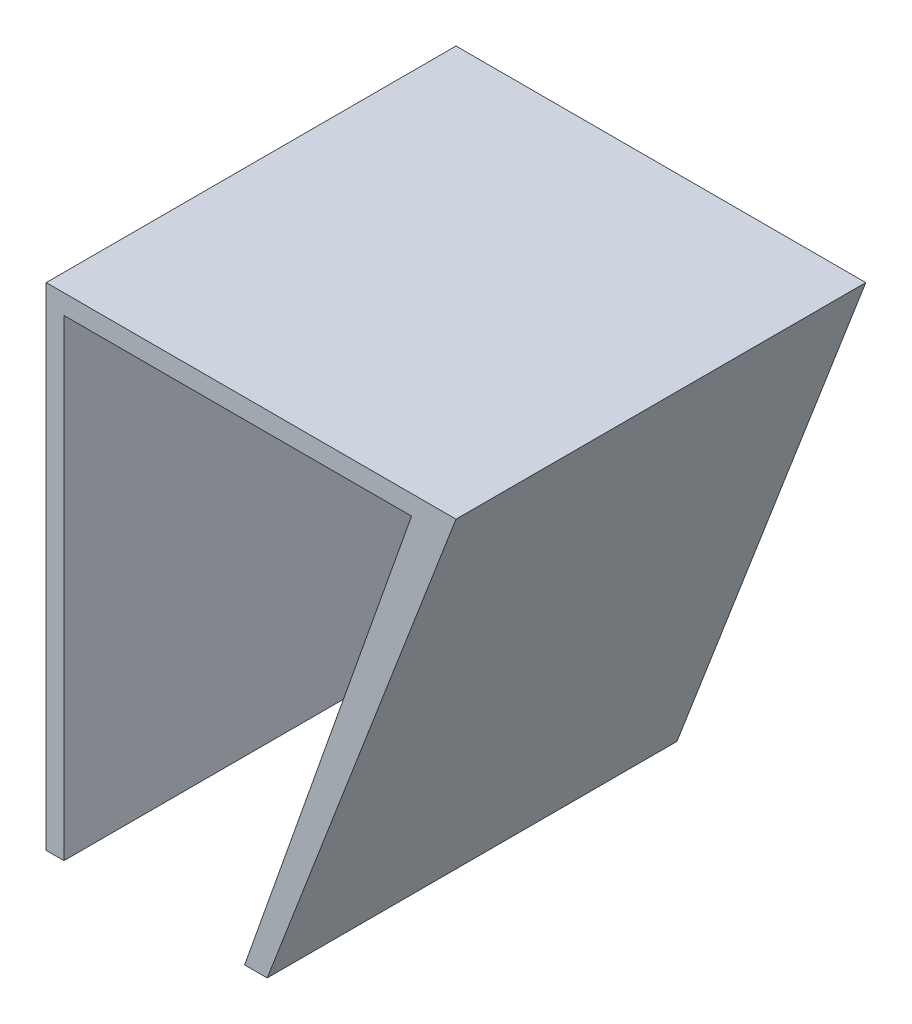
ISO-10303-21;
HEADER;
FILE_DESCRIPTION(('STEP AP214'),'2;1');
FILE_NAME('part.step','',(''),(''),'','','');
FILE_SCHEMA(('AUTOMOTIVE_DESIGN { 1 0 10303 214 1 1 1 1 }'));
ENDSEC;
DATA;
#1=APPLICATION_CONTEXT('core data for automotive mechanical design processes');
#2=APPLICATION_PROTOCOL_DEFINITION('international standard','automotive_design',2000,#1);
#3=PRODUCT_CONTEXT('',#1,'mechanical');
#4=PRODUCT('Part','Part','',(#3));
#5=PRODUCT_RELATED_PRODUCT_CATEGORY('part','',(#4));
#6=PRODUCT_DEFINITION_FORMATION('','',#4);
#7=PRODUCT_DEFINITION_CONTEXT('part definition',#1,'design');
#8=PRODUCT_DEFINITION('design','',#6,#7);
#9=PRODUCT_DEFINITION_SHAPE('','',#8);
#10=(LENGTH_UNIT() NAMED_UNIT(*) SI_UNIT(.MILLI.,.METRE.));
#11=(NAMED_UNIT(*) PLANE_ANGLE_UNIT() SI_UNIT($,.RADIAN.));
#12=(NAMED_UNIT(*) SI_UNIT($,.STERADIAN.) SOLID_ANGLE_UNIT());
#13=UNCERTAINTY_MEASURE_WITH_UNIT(LENGTH_MEASURE(1.E-05),#10,'distance_accuracy_value','');
#14=(GEOMETRIC_REPRESENTATION_CONTEXT(3) GLOBAL_UNCERTAINTY_ASSIGNED_CONTEXT((#13)) GLOBAL_UNIT_ASSIGNED_CONTEXT((#10,
#11,#12)) REPRESENTATION_CONTEXT('',''));
#15=CARTESIAN_POINT('',(0.,0.,0.));
#16=DIRECTION('',(0.,0.,1.));
#17=DIRECTION('',(1.,0.,0.));
#18=AXIS2_PLACEMENT_3D('',#15,#16,#17);
#19=CARTESIAN_POINT('',(1.64972713321255,0.,38.1));
#20=DIRECTION('',(0.,1.,0.));
#21=DIRECTION('',(0.,0.,1.));
#22=AXIS2_PLACEMENT_3D('',#19,#20,#21);
#23=PLANE('',#22);
#24=DIRECTION('',(1.,0.,0.));
#25=VECTOR('',#24,1.);
#26=CARTESIAN_POINT('',(1.64972713321255,0.,0.));
#27=LINE('',#26,#25);
#28=CARTESIAN_POINT('',(0.,0.,0.));
#29=VERTEX_POINT('',#28);
#30=CARTESIAN_POINT('',(1.64972713321255,0.,0.));
#31=VERTEX_POINT('',#30);
#32=EDGE_CURVE('E129',#29,#31,#27,.T.);
#33=ORIENTED_EDGE('',*,*,#32,.T.);
#34=DIRECTION('',(0.,0.,-1.));
#35=VECTOR('',#34,1.);
#36=CARTESIAN_POINT('',(1.64972713321255,0.,38.1));
#37=LINE('',#36,#35);
#38=CARTESIAN_POINT('',(1.64972713321255,0.,38.1));
#39=VERTEX_POINT('',#38);
#40=EDGE_CURVE('E11',#39,#31,#37,.T.);
#41=ORIENTED_EDGE('',*,*,#40,.F.);
#42=DIRECTION('',(1.,0.,0.));
#43=VECTOR('',#42,1.);
#44=CARTESIAN_POINT('',(1.64972713321255,0.,38.1));
#45=LINE('',#44,#43);
#46=CARTESIAN_POINT('',(0.,0.,38.1));
#47=VERTEX_POINT('',#46);
#48=EDGE_CURVE('E143',#47,#39,#45,.T.);
#49=ORIENTED_EDGE('',*,*,#48,.F.);
#50=DIRECTION('',(0.,0.,-1.));
#51=VECTOR('',#50,1.);
#52=CARTESIAN_POINT('',(0.,0.,38.1));
#53=LINE('',#52,#51);
#54=EDGE_CURVE('E125',#47,#29,#53,.T.);
#55=ORIENTED_EDGE('',*,*,#54,.T.);
#56=EDGE_LOOP('',(#33,#41,#49,#55));
#57=FACE_BOUND('',#56,.T.);
#58=ADVANCED_FACE('F33',(#57),#23,.F.);
#59=CARTESIAN_POINT('',(1.64972713321254,43.9002222390006,38.1));
#60=DIRECTION('',(-1.,0.,0.));
#61=DIRECTION('',(0.,-1.,0.));
#62=AXIS2_PLACEMENT_3D('',#59,#60,#61);
#63=PLANE('',#62);
#64=DIRECTION('',(0.,1.,0.));
#65=VECTOR('',#64,1.);
#66=CARTESIAN_POINT('',(1.64972713321254,43.9002222390006,0.));
#67=LINE('',#66,#65);
#68=CARTESIAN_POINT('',(1.64972713321254,43.9002222390006,0.));
#69=VERTEX_POINT('',#68);
#70=EDGE_CURVE('E132',#31,#69,#67,.T.);
#71=ORIENTED_EDGE('',*,*,#70,.T.);
#72=DIRECTION('',(0.,0.,-1.));
#73=VECTOR('',#72,1.);
#74=CARTESIAN_POINT('',(1.64972713321254,43.9002222390006,38.1));
#75=LINE('',#74,#73);
#76=CARTESIAN_POINT('',(1.64972713321254,43.9002222390006,38.1));
#77=VERTEX_POINT('',#76);
#78=EDGE_CURVE('E41',#77,#69,#75,.T.);
#79=ORIENTED_EDGE('',*,*,#78,.F.);
#80=DIRECTION('',(0.,1.,0.));
#81=VECTOR('',#80,1.);
#82=CARTESIAN_POINT('',(1.64972713321254,43.9002222390006,38.1));
#83=LINE('',#82,#81);
#84=EDGE_CURVE('E92',#39,#77,#83,.T.);
#85=ORIENTED_EDGE('',*,*,#84,.F.);
#86=ORIENTED_EDGE('',*,*,#40,.T.);
#87=EDGE_LOOP('',(#71,#79,#85,#86));
#88=FACE_BOUND('',#87,.T.);
#89=ADVANCED_FACE('F178',(#88),#63,.F.);
#90=CARTESIAN_POINT('',(1.64972713321254,43.9002222390006,38.1));
#91=DIRECTION('',(0.,1.,0.));
#92=DIRECTION('',(0.,0.,1.));
#93=AXIS2_PLACEMENT_3D('',#90,#91,#92);
#94=PLANE('',#93);
#95=DIRECTION('',(1.,0.,0.));
#96=VECTOR('',#95,1.);
#97=CARTESIAN_POINT('',(1.64972713321254,43.9002222390006,0.));
#98=LINE('',#97,#96);
#99=CARTESIAN_POINT('',(33.9666863754392,43.9002222390006,0.));
#100=VERTEX_POINT('',#99);
#101=EDGE_CURVE('E134',#69,#100,#98,.T.);
#102=ORIENTED_EDGE('',*,*,#101,.T.);
#103=DIRECTION('',(0.,0.,-1.));
#104=VECTOR('',#103,1.);
#105=CARTESIAN_POINT('',(33.9666863754392,43.9002222390006,38.1));
#106=LINE('',#105,#104);
#107=CARTESIAN_POINT('',(33.9666863754392,43.9002222390006,38.1));
#108=VERTEX_POINT('',#107);
#109=EDGE_CURVE('E150',#108,#100,#106,.T.);
#110=ORIENTED_EDGE('',*,*,#109,.F.);
#111=DIRECTION('',(1.,0.,0.));
#112=VECTOR('',#111,1.);
#113=CARTESIAN_POINT('',(1.64972713321254,43.9002222390006,38.1));
#114=LINE('',#113,#112);
#115=EDGE_CURVE('E158',#77,#108,#114,.T.);
#116=ORIENTED_EDGE('',*,*,#115,.F.);
#117=ORIENTED_EDGE('',*,*,#78,.T.);
#118=EDGE_LOOP('',(#102,#110,#116,#117));
#119=FACE_BOUND('',#118,.T.);
#120=ADVANCED_FACE('F156',(#119),#94,.F.);
#121=CARTESIAN_POINT('',(33.9666863754392,43.9002222390006,38.1));
#122=DIRECTION('',(0.942813599242945,-0.333320442041234,0.));
#123=DIRECTION('',(0.333320442041234,0.942813599242945,0.));
#124=AXIS2_PLACEMENT_3D('',#121,#122,#123);
#125=PLANE('',#124);
#126=DIRECTION('',(-0.333320442041234,-0.942813599242945,0.));
#127=VECTOR('',#126,1.);
#128=CARTESIAN_POINT('',(33.9666863754392,43.9002222390006,0.));
#129=LINE('',#128,#127);
#130=CARTESIAN_POINT('',(18.4462892426847,0.,0.));
#131=VERTEX_POINT('',#130);
#132=EDGE_CURVE('E136',#100,#131,#129,.T.);
#133=ORIENTED_EDGE('',*,*,#132,.T.);
#134=DIRECTION('',(0.,0.,-1.));
#135=VECTOR('',#134,1.);
#136=CARTESIAN_POINT('',(18.4462892426847,0.,38.1));
#137=LINE('',#136,#135);
#138=CARTESIAN_POINT('',(18.4462892426847,0.,38.1));
#139=VERTEX_POINT('',#138);
#140=EDGE_CURVE('E147',#139,#131,#137,.T.);
#141=ORIENTED_EDGE('',*,*,#140,.F.);
#142=DIRECTION('',(-0.333320442041234,-0.942813599242945,0.));
#143=VECTOR('',#142,1.);
#144=CARTESIAN_POINT('',(33.9666863754392,43.9002222390006,38.1));
#145=LINE('',#144,#143);
#146=EDGE_CURVE('E170',#108,#139,#145,.T.);
#147=ORIENTED_EDGE('',*,*,#146,.F.);
#148=ORIENTED_EDGE('',*,*,#109,.T.);
#149=EDGE_LOOP('',(#133,#141,#147,#148));
#150=FACE_BOUND('',#149,.T.);
#151=ADVANCED_FACE('F166',(#150),#125,.F.);
#152=CARTESIAN_POINT('',(20.5450258084819,0.,38.1));
#153=DIRECTION('',(0.,1.,0.));
#154=DIRECTION('',(0.,0.,1.));
#155=AXIS2_PLACEMENT_3D('',#152,#153,#154);
#156=PLANE('',#155);
#157=DIRECTION('',(1.,0.,0.));
#158=VECTOR('',#157,1.);
#159=CARTESIAN_POINT('',(20.5450258084819,0.,0.));
#160=LINE('',#159,#158);
#161=CARTESIAN_POINT('',(20.5450258084819,0.,0.));
#162=VERTEX_POINT('',#161);
#163=EDGE_CURVE('E138',#131,#162,#160,.T.);
#164=ORIENTED_EDGE('',*,*,#163,.T.);
#165=DIRECTION('',(0.,0.,-1.));
#166=VECTOR('',#165,1.);
#167=CARTESIAN_POINT('',(20.5450258084819,0.,38.1));
#168=LINE('',#167,#166);
#169=CARTESIAN_POINT('',(20.5450258084819,0.,38.1));
#170=VERTEX_POINT('',#169);
#171=EDGE_CURVE('E120',#170,#162,#168,.T.);
#172=ORIENTED_EDGE('',*,*,#171,.F.);
#173=DIRECTION('',(1.,0.,0.));
#174=VECTOR('',#173,1.);
#175=CARTESIAN_POINT('',(20.5450258084819,0.,38.1));
#176=LINE('',#175,#174);
#177=EDGE_CURVE('E111',#139,#170,#176,.T.);
#178=ORIENTED_EDGE('',*,*,#177,.F.);
#179=ORIENTED_EDGE('',*,*,#140,.T.);
#180=EDGE_LOOP('',(#164,#172,#178,#179));
#181=FACE_BOUND('',#180,.T.);
#182=ADVANCED_FACE('F169',(#181),#156,.F.);
#183=CARTESIAN_POINT('',(38.1,45.72,38.1));
#184=DIRECTION('',(-0.933548243229415,0.358451778574571,0.));
#185=DIRECTION('',(-0.358451778574571,-0.933548243229415,0.));
#186=AXIS2_PLACEMENT_3D('',#183,#184,#185);
#187=PLANE('',#186);
#188=DIRECTION('',(0.358451778574571,0.933548243229415,0.));
#189=VECTOR('',#188,1.);
#190=CARTESIAN_POINT('',(38.1,45.72,0.));
#191=LINE('',#190,#189);
#192=CARTESIAN_POINT('',(38.1,45.72,0.));
#193=VERTEX_POINT('',#192);
#194=EDGE_CURVE('E119',#162,#193,#191,.T.);
#195=ORIENTED_EDGE('',*,*,#194,.T.);
#196=DIRECTION('',(0.,0.,-1.));
#197=VECTOR('',#196,1.);
#198=CARTESIAN_POINT('',(38.1,45.72,38.1));
#199=LINE('',#198,#197);
#200=CARTESIAN_POINT('',(38.1,45.72,38.1));
#201=VERTEX_POINT('',#200);
#202=EDGE_CURVE('E116',#201,#193,#199,.T.);
#203=ORIENTED_EDGE('',*,*,#202,.F.);
#204=DIRECTION('',(0.358451778574571,0.933548243229415,0.));
#205=VECTOR('',#204,1.);
#206=CARTESIAN_POINT('',(38.1,45.72,38.1));
#207=LINE('',#206,#205);
#208=EDGE_CURVE('E105',#170,#201,#207,.T.);
#209=ORIENTED_EDGE('',*,*,#208,.F.);
#210=ORIENTED_EDGE('',*,*,#171,.T.);
#211=EDGE_LOOP('',(#195,#203,#209,#210));
#212=FACE_BOUND('',#211,.T.);
#213=ADVANCED_FACE('F117',(#212),#187,.F.);
#214=CARTESIAN_POINT('',(0.,45.72,38.1));
#215=DIRECTION('',(0.,-1.,0.));
#216=DIRECTION('',(0.,0.,-1.));
#217=AXIS2_PLACEMENT_3D('',#214,#215,#216);
#218=PLANE('',#217);
#219=DIRECTION('',(-1.,0.,0.));
#220=VECTOR('',#219,1.);
#221=CARTESIAN_POINT('',(0.,45.72,0.));
#222=LINE('',#221,#220);
#223=CARTESIAN_POINT('',(0.,45.72,0.));
#224=VERTEX_POINT('',#223);
#225=EDGE_CURVE('E78',#193,#224,#222,.T.);
#226=ORIENTED_EDGE('',*,*,#225,.T.);
#227=DIRECTION('',(0.,0.,-1.));
#228=VECTOR('',#227,1.);
#229=CARTESIAN_POINT('',(0.,45.72,38.1));
#230=LINE('',#229,#228);
#231=CARTESIAN_POINT('',(0.,45.72,38.1));
#232=VERTEX_POINT('',#231);
#233=EDGE_CURVE('E121',#232,#224,#230,.T.);
#234=ORIENTED_EDGE('',*,*,#233,.F.);
#235=DIRECTION('',(-1.,0.,0.));
#236=VECTOR('',#235,1.);
#237=CARTESIAN_POINT('',(0.,45.72,38.1));
#238=LINE('',#237,#236);
#239=EDGE_CURVE('E109',#201,#232,#238,.T.);
#240=ORIENTED_EDGE('',*,*,#239,.F.);
#241=ORIENTED_EDGE('',*,*,#202,.T.);
#242=EDGE_LOOP('',(#226,#234,#240,#241));
#243=FACE_BOUND('',#242,.T.);
#244=ADVANCED_FACE('F123',(#243),#218,.F.);
#245=CARTESIAN_POINT('',(0.,0.,38.1));
#246=DIRECTION('',(1.,0.,0.));
#247=DIRECTION('',(0.,0.,-1.));
#248=AXIS2_PLACEMENT_3D('',#245,#246,#247);
#249=PLANE('',#248);
#250=DIRECTION('',(0.,-1.,0.));
#251=VECTOR('',#250,1.);
#252=CARTESIAN_POINT('',(0.,0.,0.));
#253=LINE('',#252,#251);
#254=EDGE_CURVE('E84',#224,#29,#253,.T.);
#255=ORIENTED_EDGE('',*,*,#254,.T.);
#256=ORIENTED_EDGE('',*,*,#54,.F.);
#257=DIRECTION('',(0.,-1.,0.));
#258=VECTOR('',#257,1.);
#259=CARTESIAN_POINT('',(0.,0.,38.1));
#260=LINE('',#259,#258);
#261=EDGE_CURVE('E49',#232,#47,#260,.T.);
#262=ORIENTED_EDGE('',*,*,#261,.F.);
#263=ORIENTED_EDGE('',*,*,#233,.T.);
#264=EDGE_LOOP('',(#255,#256,#262,#263));
#265=FACE_BOUND('',#264,.T.);
#266=ADVANCED_FACE('F194',(#265),#249,.F.);
#267=CARTESIAN_POINT('',(0.,0.,38.1));
#268=DIRECTION('',(0.,0.,-1.));
#269=DIRECTION('',(-1.,0.,0.));
#270=AXIS2_PLACEMENT_3D('',#267,#268,#269);
#271=PLANE('',#270);
#272=ORIENTED_EDGE('',*,*,#48,.T.);
#273=ORIENTED_EDGE('',*,*,#84,.T.);
#274=ORIENTED_EDGE('',*,*,#115,.T.);
#275=ORIENTED_EDGE('',*,*,#146,.T.);
#276=ORIENTED_EDGE('',*,*,#177,.T.);
#277=ORIENTED_EDGE('',*,*,#208,.T.);
#278=ORIENTED_EDGE('',*,*,#239,.T.);
#279=ORIENTED_EDGE('',*,*,#261,.T.);
#280=EDGE_LOOP('',(#272,#273,#274,#275,#276,#277,#278,#279));
#281=FACE_BOUND('',#280,.T.);
#282=ADVANCED_FACE('F107',(#281),#271,.F.);
#283=CARTESIAN_POINT('',(0.,0.,0.));
#284=DIRECTION('',(0.,0.,-1.));
#285=DIRECTION('',(-1.,0.,0.));
#286=AXIS2_PLACEMENT_3D('',#283,#284,#285);
#287=PLANE('',#286);
#288=ORIENTED_EDGE('',*,*,#32,.F.);
#289=ORIENTED_EDGE('',*,*,#254,.F.);
#290=ORIENTED_EDGE('',*,*,#225,.F.);
#291=ORIENTED_EDGE('',*,*,#194,.F.);
#292=ORIENTED_EDGE('',*,*,#163,.F.);
#293=ORIENTED_EDGE('',*,*,#132,.F.);
#294=ORIENTED_EDGE('',*,*,#101,.F.);
#295=ORIENTED_EDGE('',*,*,#70,.F.);
#296=EDGE_LOOP('',(#288,#289,#290,#291,#292,#293,#294,#295));
#297=FACE_BOUND('',#296,.T.);
#298=ADVANCED_FACE('F162',(#297),#287,.T.);
#299=CLOSED_SHELL('',(#58,#89,#120,#151,#182,#213,#244,#266,#282,#298));
#300=MANIFOLD_SOLID_BREP('B2',#299);
#301=ADVANCED_BREP_SHAPE_REPRESENTATION('',(#18,#300),#14);
#302=SHAPE_DEFINITION_REPRESENTATION(#9,#301);
ENDSEC;
END-ISO-10303-21;
